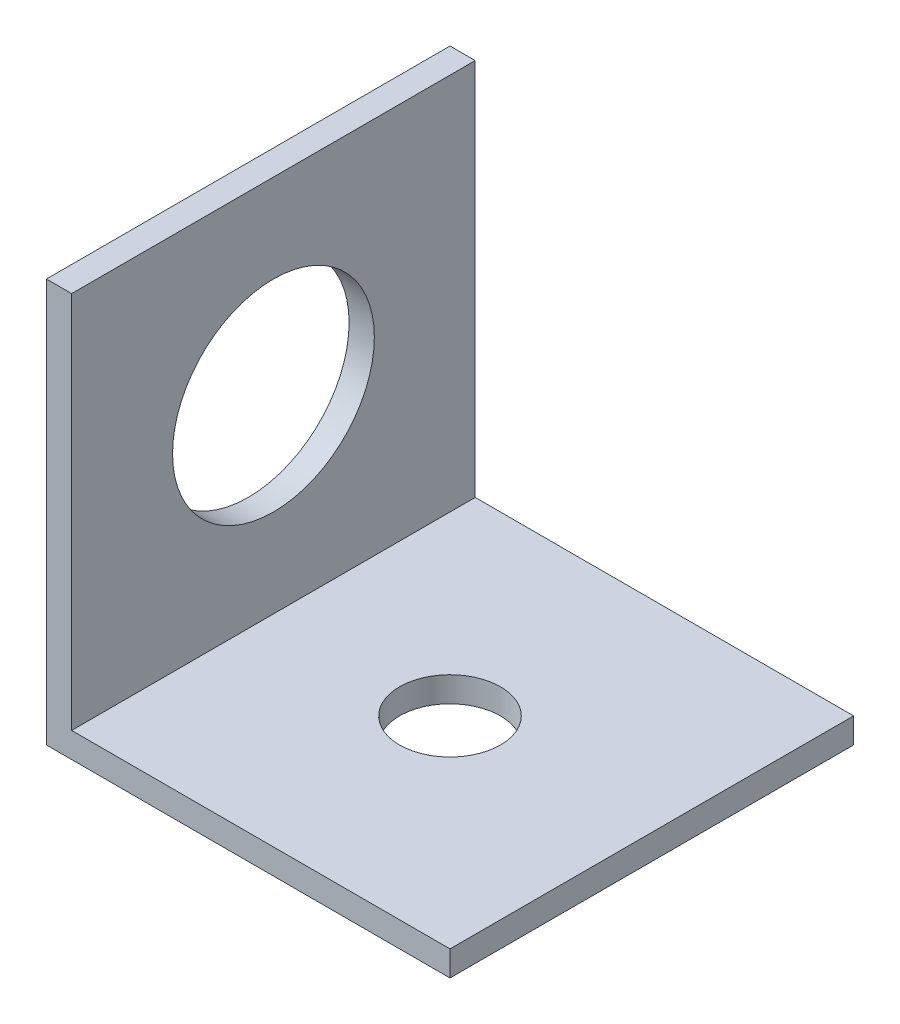
ISO-10303-21;
HEADER;
FILE_DESCRIPTION(('STEP AP214'),'2;1');
FILE_NAME('part.step','',(''),(''),'','','');
FILE_SCHEMA(('AUTOMOTIVE_DESIGN { 1 0 10303 214 1 1 1 1 }'));
ENDSEC;
DATA;
#1=APPLICATION_CONTEXT('core data for automotive mechanical design processes');
#2=APPLICATION_PROTOCOL_DEFINITION('international standard','automotive_design',2000,#1);
#3=PRODUCT_CONTEXT('',#1,'mechanical');
#4=PRODUCT('Part','Part','',(#3));
#5=PRODUCT_RELATED_PRODUCT_CATEGORY('part','',(#4));
#6=PRODUCT_DEFINITION_FORMATION('','',#4);
#7=PRODUCT_DEFINITION_CONTEXT('part definition',#1,'design');
#8=PRODUCT_DEFINITION('design','',#6,#7);
#9=PRODUCT_DEFINITION_SHAPE('','',#8);
#10=(LENGTH_UNIT() NAMED_UNIT(*) SI_UNIT(.MILLI.,.METRE.));
#11=(NAMED_UNIT(*) PLANE_ANGLE_UNIT() SI_UNIT($,.RADIAN.));
#12=(NAMED_UNIT(*) SI_UNIT($,.STERADIAN.) SOLID_ANGLE_UNIT());
#13=UNCERTAINTY_MEASURE_WITH_UNIT(LENGTH_MEASURE(1.E-05),#10,'distance_accuracy_value','');
#14=(GEOMETRIC_REPRESENTATION_CONTEXT(3) GLOBAL_UNCERTAINTY_ASSIGNED_CONTEXT((#13)) GLOBAL_UNIT_ASSIGNED_CONTEXT((#10,
#11,#12)) REPRESENTATION_CONTEXT('',''));
#15=CARTESIAN_POINT('',(0.,0.,0.));
#16=DIRECTION('',(0.,0.,1.));
#17=DIRECTION('',(1.,0.,0.));
#18=AXIS2_PLACEMENT_3D('',#15,#16,#17);
#19=CARTESIAN_POINT('',(25.4,0.,25.4));
#20=DIRECTION('',(0.,1.,0.));
#21=DIRECTION('',(0.,0.,1.));
#22=AXIS2_PLACEMENT_3D('',#19,#20,#21);
#23=PLANE('',#22);
#24=CARTESIAN_POINT('',(12.7,0.,12.7));
#25=DIRECTION('',(0.,1.,0.));
#26=DIRECTION('',(0.,0.,1.));
#27=AXIS2_PLACEMENT_3D('',#24,#25,#26);
#28=CIRCLE('',#27,3.175);
#29=CARTESIAN_POINT('',(12.7,0.,15.875));
#30=VERTEX_POINT('',#29);
#31=EDGE_CURVE('E134',#30,#30,#28,.T.);
#32=ORIENTED_EDGE('',*,*,#31,.T.);
#33=EDGE_LOOP('',(#32));
#34=FACE_BOUND('',#33,.T.);
#35=DIRECTION('',(1.,0.,0.));
#36=VECTOR('',#35,1.);
#37=CARTESIAN_POINT('',(25.4,0.,0.));
#38=LINE('',#37,#36);
#39=CARTESIAN_POINT('',(0.,0.,0.));
#40=VERTEX_POINT('',#39);
#41=CARTESIAN_POINT('',(25.4,0.,0.));
#42=VERTEX_POINT('',#41);
#43=EDGE_CURVE('E129',#40,#42,#38,.T.);
#44=ORIENTED_EDGE('',*,*,#43,.T.);
#45=DIRECTION('',(0.,0.,-1.));
#46=VECTOR('',#45,1.);
#47=CARTESIAN_POINT('',(25.4,0.,25.4));
#48=LINE('',#47,#46);
#49=CARTESIAN_POINT('',(25.4,0.,25.4));
#50=VERTEX_POINT('',#49);
#51=EDGE_CURVE('E11',#50,#42,#48,.T.);
#52=ORIENTED_EDGE('',*,*,#51,.F.);
#53=DIRECTION('',(1.,0.,0.));
#54=VECTOR('',#53,1.);
#55=CARTESIAN_POINT('',(25.4,0.,25.4));
#56=LINE('',#55,#54);
#57=CARTESIAN_POINT('',(0.,0.,25.4));
#58=VERTEX_POINT('',#57);
#59=EDGE_CURVE('E146',#58,#50,#56,.T.);
#60=ORIENTED_EDGE('',*,*,#59,.F.);
#61=DIRECTION('',(0.,0.,-1.));
#62=VECTOR('',#61,1.);
#63=CARTESIAN_POINT('',(0.,0.,25.4));
#64=LINE('',#63,#62);
#65=EDGE_CURVE('E125',#58,#40,#64,.T.);
#66=ORIENTED_EDGE('',*,*,#65,.T.);
#67=EDGE_LOOP('',(#44,#52,#60,#66));
#68=FACE_BOUND('',#67,.T.);
#69=ADVANCED_FACE('F39',(#34,#68),#23,.F.);
#70=CARTESIAN_POINT('',(25.4,1.5875,25.4));
#71=DIRECTION('',(-1.,0.,0.));
#72=DIRECTION('',(0.,0.,1.));
#73=AXIS2_PLACEMENT_3D('',#70,#71,#72);
#74=PLANE('',#73);
#75=DIRECTION('',(0.,1.,0.));
#76=VECTOR('',#75,1.);
#77=CARTESIAN_POINT('',(25.4,1.5875,0.));
#78=LINE('',#77,#76);
#79=CARTESIAN_POINT('',(25.4,1.5875,0.));
#80=VERTEX_POINT('',#79);
#81=EDGE_CURVE('E133',#42,#80,#78,.T.);
#82=ORIENTED_EDGE('',*,*,#81,.T.);
#83=DIRECTION('',(0.,0.,-1.));
#84=VECTOR('',#83,1.);
#85=CARTESIAN_POINT('',(25.4,1.5875,25.4));
#86=LINE('',#85,#84);
#87=CARTESIAN_POINT('',(25.4,1.5875,25.4));
#88=VERTEX_POINT('',#87);
#89=EDGE_CURVE('E49',#88,#80,#86,.T.);
#90=ORIENTED_EDGE('',*,*,#89,.F.);
#91=DIRECTION('',(0.,1.,0.));
#92=VECTOR('',#91,1.);
#93=CARTESIAN_POINT('',(25.4,1.5875,25.4));
#94=LINE('',#93,#92);
#95=EDGE_CURVE('E94',#50,#88,#94,.T.);
#96=ORIENTED_EDGE('',*,*,#95,.F.);
#97=ORIENTED_EDGE('',*,*,#51,.T.);
#98=EDGE_LOOP('',(#82,#90,#96,#97));
#99=FACE_BOUND('',#98,.T.);
#100=ADVANCED_FACE('F177',(#99),#74,.F.);
#101=CARTESIAN_POINT('',(1.5875,1.5875,25.4));
#102=DIRECTION('',(0.,-1.,0.));
#103=DIRECTION('',(0.,0.,-1.));
#104=AXIS2_PLACEMENT_3D('',#101,#102,#103);
#105=PLANE('',#104);
#106=CARTESIAN_POINT('',(12.7,1.5875,12.7));
#107=DIRECTION('',(0.,1.,0.));
#108=DIRECTION('',(0.,0.,1.));
#109=AXIS2_PLACEMENT_3D('',#106,#107,#108);
#110=CIRCLE('',#109,3.175);
#111=CARTESIAN_POINT('',(12.7,1.5875,15.875));
#112=VERTEX_POINT('',#111);
#113=EDGE_CURVE('E186',#112,#112,#110,.T.);
#114=ORIENTED_EDGE('',*,*,#113,.F.);
#115=EDGE_LOOP('',(#114));
#116=FACE_BOUND('',#115,.T.);
#117=DIRECTION('',(-1.,0.,0.));
#118=VECTOR('',#117,1.);
#119=CARTESIAN_POINT('',(1.5875,1.5875,0.));
#120=LINE('',#119,#118);
#121=CARTESIAN_POINT('',(1.5875,1.5875,0.));
#122=VERTEX_POINT('',#121);
#123=EDGE_CURVE('E137',#80,#122,#120,.T.);
#124=ORIENTED_EDGE('',*,*,#123,.T.);
#125=DIRECTION('',(0.,0.,-1.));
#126=VECTOR('',#125,1.);
#127=CARTESIAN_POINT('',(1.5875,1.5875,25.4));
#128=LINE('',#127,#126);
#129=CARTESIAN_POINT('',(1.5875,1.5875,25.4));
#130=VERTEX_POINT('',#129);
#131=EDGE_CURVE('E118',#130,#122,#128,.T.);
#132=ORIENTED_EDGE('',*,*,#131,.F.);
#133=DIRECTION('',(-1.,0.,0.));
#134=VECTOR('',#133,1.);
#135=CARTESIAN_POINT('',(1.5875,1.5875,25.4));
#136=LINE('',#135,#134);
#137=EDGE_CURVE('E107',#88,#130,#136,.T.);
#138=ORIENTED_EDGE('',*,*,#137,.F.);
#139=ORIENTED_EDGE('',*,*,#89,.T.);
#140=EDGE_LOOP('',(#124,#132,#138,#139));
#141=FACE_BOUND('',#140,.T.);
#142=ADVANCED_FACE('F157',(#116,#141),#105,.F.);
#143=CARTESIAN_POINT('',(1.5875,25.4,25.4));
#144=DIRECTION('',(-1.,0.,0.));
#145=DIRECTION('',(0.,-1.,0.));
#146=AXIS2_PLACEMENT_3D('',#143,#144,#145);
#147=PLANE('',#146);
#148=CARTESIAN_POINT('',(1.5875,13.49375,12.7));
#149=DIRECTION('',(1.,0.,0.));
#150=DIRECTION('',(0.,1.,0.));
#151=AXIS2_PLACEMENT_3D('',#148,#149,#150);
#152=CIRCLE('',#151,6.35);
#153=CARTESIAN_POINT('',(1.5875,19.84375,12.7));
#154=VERTEX_POINT('',#153);
#155=EDGE_CURVE('E197',#154,#154,#152,.T.);
#156=ORIENTED_EDGE('',*,*,#155,.F.);
#157=EDGE_LOOP('',(#156));
#158=FACE_BOUND('',#157,.T.);
#159=DIRECTION('',(0.,1.,0.));
#160=VECTOR('',#159,1.);
#161=CARTESIAN_POINT('',(1.5875,25.4,0.));
#162=LINE('',#161,#160);
#163=CARTESIAN_POINT('',(1.5875,25.4,0.));
#164=VERTEX_POINT('',#163);
#165=EDGE_CURVE('E116',#122,#164,#162,.T.);
#166=ORIENTED_EDGE('',*,*,#165,.T.);
#167=DIRECTION('',(0.,0.,-1.));
#168=VECTOR('',#167,1.);
#169=CARTESIAN_POINT('',(1.5875,25.4,25.4));
#170=LINE('',#169,#168);
#171=CARTESIAN_POINT('',(1.5875,25.4,25.4));
#172=VERTEX_POINT('',#171);
#173=EDGE_CURVE('E113',#172,#164,#170,.T.);
#174=ORIENTED_EDGE('',*,*,#173,.F.);
#175=DIRECTION('',(0.,1.,0.));
#176=VECTOR('',#175,1.);
#177=CARTESIAN_POINT('',(1.5875,25.4,25.4));
#178=LINE('',#177,#176);
#179=EDGE_CURVE('E101',#130,#172,#178,.T.);
#180=ORIENTED_EDGE('',*,*,#179,.F.);
#181=ORIENTED_EDGE('',*,*,#131,.T.);
#182=EDGE_LOOP('',(#166,#174,#180,#181));
#183=FACE_BOUND('',#182,.T.);
#184=ADVANCED_FACE('F114',(#158,#183),#147,.F.);
#185=CARTESIAN_POINT('',(0.,25.4,25.4));
#186=DIRECTION('',(0.,-1.,0.));
#187=DIRECTION('',(0.,0.,-1.));
#188=AXIS2_PLACEMENT_3D('',#185,#186,#187);
#189=PLANE('',#188);
#190=DIRECTION('',(-1.,0.,0.));
#191=VECTOR('',#190,1.);
#192=CARTESIAN_POINT('',(0.,25.4,0.));
#193=LINE('',#192,#191);
#194=CARTESIAN_POINT('',(0.,25.4,0.));
#195=VERTEX_POINT('',#194);
#196=EDGE_CURVE('E80',#164,#195,#193,.T.);
#197=ORIENTED_EDGE('',*,*,#196,.T.);
#198=DIRECTION('',(0.,0.,-1.));
#199=VECTOR('',#198,1.);
#200=CARTESIAN_POINT('',(0.,25.4,25.4));
#201=LINE('',#200,#199);
#202=CARTESIAN_POINT('',(0.,25.4,25.4));
#203=VERTEX_POINT('',#202);
#204=EDGE_CURVE('E119',#203,#195,#201,.T.);
#205=ORIENTED_EDGE('',*,*,#204,.F.);
#206=DIRECTION('',(-1.,0.,0.));
#207=VECTOR('',#206,1.);
#208=CARTESIAN_POINT('',(0.,25.4,25.4));
#209=LINE('',#208,#207);
#210=EDGE_CURVE('E105',#172,#203,#209,.T.);
#211=ORIENTED_EDGE('',*,*,#210,.F.);
#212=ORIENTED_EDGE('',*,*,#173,.T.);
#213=EDGE_LOOP('',(#197,#205,#211,#212));
#214=FACE_BOUND('',#213,.T.);
#215=ADVANCED_FACE('F121',(#214),#189,.F.);
#216=CARTESIAN_POINT('',(0.,0.,25.4));
#217=DIRECTION('',(1.,0.,0.));
#218=DIRECTION('',(0.,0.,-1.));
#219=AXIS2_PLACEMENT_3D('',#216,#217,#218);
#220=PLANE('',#219);
#221=CARTESIAN_POINT('',(0.,13.49375,12.7));
#222=DIRECTION('',(1.,0.,0.));
#223=DIRECTION('',(0.,0.,-1.));
#224=AXIS2_PLACEMENT_3D('',#221,#222,#223);
#225=CIRCLE('',#224,6.35);
#226=CARTESIAN_POINT('',(0.,13.49375,6.35));
#227=VERTEX_POINT('',#226);
#228=EDGE_CURVE('E42',#227,#227,#225,.T.);
#229=ORIENTED_EDGE('',*,*,#228,.T.);
#230=EDGE_LOOP('',(#229));
#231=FACE_BOUND('',#230,.T.);
#232=DIRECTION('',(0.,-1.,0.));
#233=VECTOR('',#232,1.);
#234=CARTESIAN_POINT('',(0.,0.,0.));
#235=LINE('',#234,#233);
#236=EDGE_CURVE('E86',#195,#40,#235,.T.);
#237=ORIENTED_EDGE('',*,*,#236,.T.);
#238=ORIENTED_EDGE('',*,*,#65,.F.);
#239=DIRECTION('',(0.,-1.,0.));
#240=VECTOR('',#239,1.);
#241=CARTESIAN_POINT('',(0.,0.,25.4));
#242=LINE('',#241,#240);
#243=EDGE_CURVE('E57',#203,#58,#242,.T.);
#244=ORIENTED_EDGE('',*,*,#243,.F.);
#245=ORIENTED_EDGE('',*,*,#204,.T.);
#246=EDGE_LOOP('',(#237,#238,#244,#245));
#247=FACE_BOUND('',#246,.T.);
#248=ADVANCED_FACE('F164',(#231,#247),#220,.F.);
#249=CARTESIAN_POINT('',(0.,0.,25.4));
#250=DIRECTION('',(0.,0.,-1.));
#251=DIRECTION('',(-1.,0.,0.));
#252=AXIS2_PLACEMENT_3D('',#249,#250,#251);
#253=PLANE('',#252);
#254=ORIENTED_EDGE('',*,*,#59,.T.);
#255=ORIENTED_EDGE('',*,*,#95,.T.);
#256=ORIENTED_EDGE('',*,*,#137,.T.);
#257=ORIENTED_EDGE('',*,*,#179,.T.);
#258=ORIENTED_EDGE('',*,*,#210,.T.);
#259=ORIENTED_EDGE('',*,*,#243,.T.);
#260=EDGE_LOOP('',(#254,#255,#256,#257,#258,#259));
#261=FACE_BOUND('',#260,.T.);
#262=ADVANCED_FACE('F103',(#261),#253,.F.);
#263=CARTESIAN_POINT('',(0.,0.,0.));
#264=DIRECTION('',(0.,0.,-1.));
#265=DIRECTION('',(-1.,0.,0.));
#266=AXIS2_PLACEMENT_3D('',#263,#264,#265);
#267=PLANE('',#266);
#268=ORIENTED_EDGE('',*,*,#43,.F.);
#269=ORIENTED_EDGE('',*,*,#236,.F.);
#270=ORIENTED_EDGE('',*,*,#196,.F.);
#271=ORIENTED_EDGE('',*,*,#165,.F.);
#272=ORIENTED_EDGE('',*,*,#123,.F.);
#273=ORIENTED_EDGE('',*,*,#81,.F.);
#274=EDGE_LOOP('',(#268,#269,#270,#271,#272,#273));
#275=FACE_BOUND('',#274,.T.);
#276=ADVANCED_FACE('F160',(#275),#267,.T.);
#277=CARTESIAN_POINT('',(12.7,-23.8125,12.7));
#278=DIRECTION('',(0.,1.,0.));
#279=DIRECTION('',(0.,0.,1.));
#280=AXIS2_PLACEMENT_3D('',#277,#278,#279);
#281=CYLINDRICAL_SURFACE('',#280,3.175);
#282=ORIENTED_EDGE('',*,*,#113,.T.);
#283=EDGE_LOOP('',(#282));
#284=FACE_BOUND('',#283,.T.);
#285=ORIENTED_EDGE('',*,*,#31,.F.);
#286=EDGE_LOOP('',(#285));
#287=FACE_BOUND('',#286,.T.);
#288=ADVANCED_FACE('F207',(#284,#287),#281,.F.);
#289=CARTESIAN_POINT('',(-23.8125,13.49375,12.7));
#290=DIRECTION('',(1.,0.,0.));
#291=DIRECTION('',(0.,1.,0.));
#292=AXIS2_PLACEMENT_3D('',#289,#290,#291);
#293=CYLINDRICAL_SURFACE('',#292,6.35);
#294=ORIENTED_EDGE('',*,*,#155,.T.);
#295=EDGE_LOOP('',(#294));
#296=FACE_BOUND('',#295,.T.);
#297=ORIENTED_EDGE('',*,*,#228,.F.);
#298=EDGE_LOOP('',(#297));
#299=FACE_BOUND('',#298,.T.);
#300=ADVANCED_FACE('F205',(#296,#299),#293,.F.);
#301=CLOSED_SHELL('',(#69,#100,#142,#184,#215,#248,#262,#276,#288,#300));
#302=MANIFOLD_SOLID_BREP('B2',#301);
#303=ADVANCED_BREP_SHAPE_REPRESENTATION('',(#18,#302),#14);
#304=SHAPE_DEFINITION_REPRESENTATION(#9,#303);
ENDSEC;
END-ISO-10303-21;
